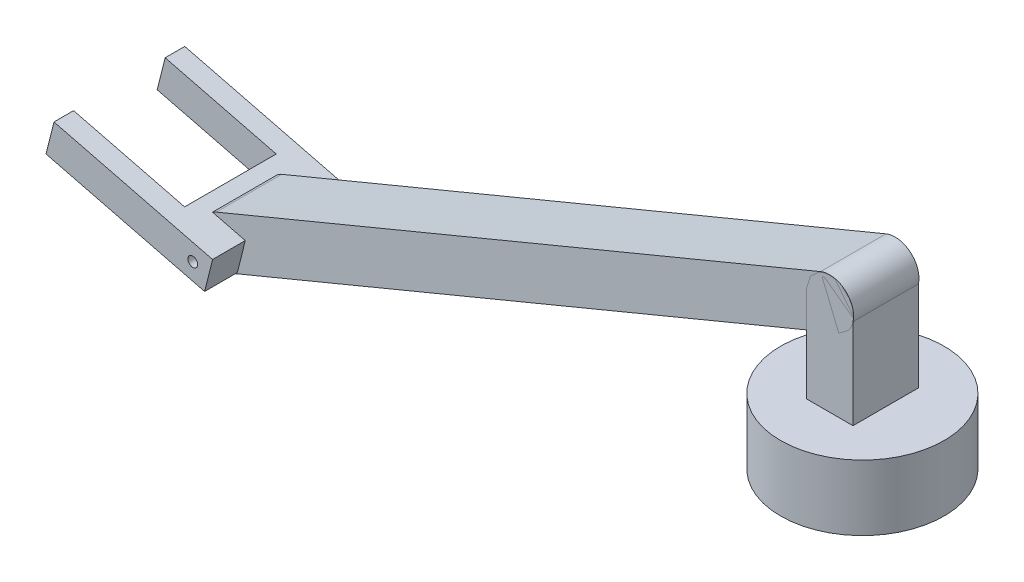
ISO-10303-21;
HEADER;
FILE_DESCRIPTION(('STEP AP214'),'2;1');
FILE_NAME('part.step','',(''),(''),'','','');
FILE_SCHEMA(('AUTOMOTIVE_DESIGN { 1 0 10303 214 1 1 1 1 }'));
ENDSEC;
DATA;
#1=APPLICATION_CONTEXT('core data for automotive mechanical design processes');
#2=APPLICATION_PROTOCOL_DEFINITION('international standard','automotive_design',2000,#1);
#3=PRODUCT_CONTEXT('',#1,'mechanical');
#4=PRODUCT('Part','Part','',(#3));
#5=PRODUCT_RELATED_PRODUCT_CATEGORY('part','',(#4));
#6=PRODUCT_DEFINITION_FORMATION('','',#4);
#7=PRODUCT_DEFINITION_CONTEXT('part definition',#1,'design');
#8=PRODUCT_DEFINITION('design','',#6,#7);
#9=PRODUCT_DEFINITION_SHAPE('','',#8);
#10=(LENGTH_UNIT() NAMED_UNIT(*) SI_UNIT(.MILLI.,.METRE.));
#11=(NAMED_UNIT(*) PLANE_ANGLE_UNIT() SI_UNIT($,.RADIAN.));
#12=(NAMED_UNIT(*) SI_UNIT($,.STERADIAN.) SOLID_ANGLE_UNIT());
#13=UNCERTAINTY_MEASURE_WITH_UNIT(LENGTH_MEASURE(1.E-05),#10,'distance_accuracy_value','');
#14=(GEOMETRIC_REPRESENTATION_CONTEXT(3) GLOBAL_UNCERTAINTY_ASSIGNED_CONTEXT((#13)) GLOBAL_UNIT_ASSIGNED_CONTEXT((#10,
#11,#12)) REPRESENTATION_CONTEXT('',''));
#15=CARTESIAN_POINT('',(0.,0.,0.));
#16=DIRECTION('',(0.,0.,1.));
#17=DIRECTION('',(1.,0.,0.));
#18=AXIS2_PLACEMENT_3D('',#15,#16,#17);
#19=CARTESIAN_POINT('',(-229.608432133908,-21.419351301532,30.));
#20=DIRECTION('',(0.969976087198979,-0.24320030892694,0.));
#21=DIRECTION('',(0.243200308926941,0.969976087198979,0.));
#22=AXIS2_PLACEMENT_3D('',#19,#20,#21);
#23=PLANE('',#22);
#24=DIRECTION('',(0.,0.,-1.));
#25=VECTOR('',#24,1.);
#26=CARTESIAN_POINT('',(-227.176429044639,-11.719590429542,30.));
#27=LINE('',#26,#25);
#28=CARTESIAN_POINT('',(-227.176429044639,-11.719590429542,-14.));
#29=VERTEX_POINT('',#28);
#30=CARTESIAN_POINT('',(-227.176429044639,-11.719590429542,-20.));
#31=VERTEX_POINT('',#30);
#32=EDGE_CURVE('E165',#29,#31,#27,.T.);
#33=ORIENTED_EDGE('',*,*,#32,.T.);
#34=DIRECTION('',(-0.243200308926941,-0.969976087198979,0.));
#35=VECTOR('',#34,1.);
#36=CARTESIAN_POINT('',(-229.608432133908,-21.419351301532,-20.));
#37=LINE('',#36,#35);
#38=CARTESIAN_POINT('',(-229.608432133908,-21.419351301532,-20.));
#39=VERTEX_POINT('',#38);
#40=EDGE_CURVE('E12',#31,#39,#37,.T.);
#41=ORIENTED_EDGE('',*,*,#40,.T.);
#42=DIRECTION('',(0.,0.,-1.));
#43=VECTOR('',#42,1.);
#44=CARTESIAN_POINT('',(-229.608432133908,-21.419351301532,30.));
#45=LINE('',#44,#43);
#46=CARTESIAN_POINT('',(-229.608432133908,-21.419351301532,-14.));
#47=VERTEX_POINT('',#46);
#48=EDGE_CURVE('E178',#47,#39,#45,.T.);
#49=ORIENTED_EDGE('',*,*,#48,.F.);
#50=DIRECTION('',(0.243200308926941,0.969976087198979,0.));
#51=VECTOR('',#50,1.);
#52=CARTESIAN_POINT('',(-229.608432133908,-21.419351301532,-14.));
#53=LINE('',#52,#51);
#54=EDGE_CURVE('E50',#47,#29,#53,.T.);
#55=ORIENTED_EDGE('',*,*,#54,.T.);
#56=EDGE_LOOP('',(#33,#41,#49,#55));
#57=FACE_BOUND('',#56,.T.);
#58=ADVANCED_FACE('F42',(#57),#23,.F.);
#59=CARTESIAN_POINT('',(-184.743506665319,-27.5134847672489,10.));
#60=DIRECTION('',(0.,0.,-1.));
#61=DIRECTION('',(-1.,0.,0.));
#62=AXIS2_PLACEMENT_3D('',#59,#60,#61);
#63=CYLINDRICAL_SURFACE('',#62,7.30197744368311);
#64=DIRECTION('',(0.,0.,-1.));
#65=VECTOR('',#64,1.);
#66=CARTESIAN_POINT('',(-191.121282650966,-31.0691630520441,10.));
#67=LINE('',#66,#65);
#68=CARTESIAN_POINT('',(-191.121282650966,-31.069163052044,-10.));
#69=VERTEX_POINT('',#68);
#70=CARTESIAN_POINT('',(-191.121282650966,-31.069163052044,10.));
#71=VERTEX_POINT('',#70);
#72=EDGE_CURVE('E202',#69,#71,#67,.F.);
#73=ORIENTED_EDGE('',*,*,#72,.F.);
#74=CARTESIAN_POINT('',(-184.743506665319,-27.5134847672489,-10.));
#75=DIRECTION('',(0.,0.,1.));
#76=DIRECTION('',(1.,0.,0.));
#77=AXIS2_PLACEMENT_3D('',#74,#75,#76);
#78=CIRCLE('',#77,7.30197744368311);
#79=CARTESIAN_POINT('',(-181.946306774093,-34.2584493599343,-10.));
#80=VERTEX_POINT('',#79);
#81=EDGE_CURVE('E225',#69,#80,#78,.T.);
#82=ORIENTED_EDGE('',*,*,#81,.T.);
#83=DIRECTION('',(0.,0.,-1.));
#84=VECTOR('',#83,1.);
#85=CARTESIAN_POINT('',(-181.946306774093,-34.2584493599343,10.));
#86=LINE('',#85,#84);
#87=CARTESIAN_POINT('',(-181.946306774093,-34.2584493599343,10.));
#88=VERTEX_POINT('',#87);
#89=EDGE_CURVE('E232',#88,#80,#86,.T.);
#90=ORIENTED_EDGE('',*,*,#89,.F.);
#91=CARTESIAN_POINT('',(-184.743506665319,-27.5134847672489,10.));
#92=DIRECTION('',(0.,0.,1.));
#93=DIRECTION('',(1.,0.,0.));
#94=AXIS2_PLACEMENT_3D('',#91,#92,#93);
#95=CIRCLE('',#94,7.30197744368311);
#96=EDGE_CURVE('E214',#71,#88,#95,.T.);
#97=ORIENTED_EDGE('',*,*,#96,.F.);
#98=EDGE_LOOP('',(#73,#82,#90,#97));
#99=FACE_BOUND('',#98,.T.);
#100=ADVANCED_FACE('F320',(#99),#63,.T.);
#101=DIRECTION('',(0.,0.,-1.));
#102=VECTOR('',#101,1.);
#103=CARTESIAN_POINT('',(-188.689279561697,-21.3694021800542,10.));
#104=LINE('',#103,#102);
#105=CARTESIAN_POINT('',(-188.689279561697,-21.3694021800542,10.));
#106=VERTEX_POINT('',#105);
#107=CARTESIAN_POINT('',(-188.689279561697,-21.3694021800542,-10.));
#108=VERTEX_POINT('',#107);
#109=EDGE_CURVE('E193',#106,#108,#104,.T.);
#110=ORIENTED_EDGE('',*,*,#109,.F.);
#111=CARTESIAN_POINT('',(-187.540706556546,-20.7685201745635,10.));
#112=VERTEX_POINT('',#111);
#113=EDGE_CURVE('E215',#112,#106,#95,.T.);
#114=ORIENTED_EDGE('',*,*,#113,.F.);
#115=DIRECTION('',(0.,0.,-1.));
#116=VECTOR('',#115,1.);
#117=CARTESIAN_POINT('',(-187.540706556546,-20.7685201745635,10.));
#118=LINE('',#117,#116);
#119=CARTESIAN_POINT('',(-187.540706556546,-20.7685201745635,-10.));
#120=VERTEX_POINT('',#119);
#121=EDGE_CURVE('E235',#112,#120,#118,.T.);
#122=ORIENTED_EDGE('',*,*,#121,.T.);
#123=EDGE_CURVE('E226',#120,#108,#78,.T.);
#124=ORIENTED_EDGE('',*,*,#123,.T.);
#125=EDGE_LOOP('',(#110,#114,#122,#124));
#126=FACE_BOUND('',#125,.T.);
#127=ADVANCED_FACE('F325',(#126),#63,.T.);
#128=CARTESIAN_POINT('',(0.,49.1013750512041,10.));
#129=DIRECTION('',(0.,0.,-1.));
#130=DIRECTION('',(-1.,0.,0.));
#131=AXIS2_PLACEMENT_3D('',#128,#129,#130);
#132=CYLINDRICAL_SURFACE('',#131,7.30197744368306);
#133=CARTESIAN_POINT('',(0.,49.1013750512041,-10.));
#134=DIRECTION('',(0.,0.,1.));
#135=DIRECTION('',(1.,0.,0.));
#136=AXIS2_PLACEMENT_3D('',#133,#134,#135);
#137=CIRCLE('',#136,7.30197744368306);
#138=CARTESIAN_POINT('',(2.79719989122643,42.3564104585188,-10.));
#139=VERTEX_POINT('',#138);
#140=CARTESIAN_POINT('',(-2.79719989122641,55.8463396438895,-10.));
#141=VERTEX_POINT('',#140);
#142=EDGE_CURVE('E207',#139,#141,#137,.T.);
#143=ORIENTED_EDGE('',*,*,#142,.T.);
#144=DIRECTION('',(0.,0.,-1.));
#145=VECTOR('',#144,1.);
#146=CARTESIAN_POINT('',(-2.79719989122641,55.8463396438895,10.));
#147=LINE('',#146,#145);
#148=CARTESIAN_POINT('',(-2.79719989122641,55.8463396438895,10.));
#149=VERTEX_POINT('',#148);
#150=EDGE_CURVE('E238',#149,#141,#147,.T.);
#151=ORIENTED_EDGE('',*,*,#150,.F.);
#152=CARTESIAN_POINT('',(0.,49.1013750512041,10.));
#153=DIRECTION('',(0.,0.,1.));
#154=DIRECTION('',(1.,0.,0.));
#155=AXIS2_PLACEMENT_3D('',#152,#153,#154);
#156=CIRCLE('',#155,7.30197744368306);
#157=CARTESIAN_POINT('',(2.79719989122643,42.3564104585188,10.));
#158=VERTEX_POINT('',#157);
#159=EDGE_CURVE('E208',#158,#149,#156,.T.);
#160=ORIENTED_EDGE('',*,*,#159,.F.);
#161=DIRECTION('',(0.,0.,-1.));
#162=VECTOR('',#161,1.);
#163=CARTESIAN_POINT('',(2.79719989122643,42.3564104585188,10.));
#164=LINE('',#163,#162);
#165=EDGE_CURVE('E220',#158,#139,#164,.T.);
#166=ORIENTED_EDGE('',*,*,#165,.T.);
#167=EDGE_LOOP('',(#143,#151,#160,#166));
#168=FACE_BOUND('',#167,.T.);
#169=ADVANCED_FACE('F44',(#168),#132,.T.);
#170=CARTESIAN_POINT('',(-2.79719989122641,55.8463396438895,10.));
#171=DIRECTION('',(0.383074299092265,-0.923717533326595,0.));
#172=DIRECTION('',(0.923717533326596,0.383074299092265,0.));
#173=AXIS2_PLACEMENT_3D('',#170,#171,#172);
#174=PLANE('',#173);
#175=DIRECTION('',(-0.923717533326596,-0.383074299092265,0.));
#176=VECTOR('',#175,1.);
#177=CARTESIAN_POINT('',(-2.79719989122641,55.8463396438895,-10.));
#178=LINE('',#177,#176);
#179=EDGE_CURVE('E223',#141,#120,#178,.T.);
#180=ORIENTED_EDGE('',*,*,#179,.T.);
#181=ORIENTED_EDGE('',*,*,#121,.F.);
#182=DIRECTION('',(-0.923717533326596,-0.383074299092265,0.));
#183=VECTOR('',#182,1.);
#184=CARTESIAN_POINT('',(-2.79719989122641,55.8463396438895,10.));
#185=LINE('',#184,#183);
#186=EDGE_CURVE('E211',#149,#112,#185,.T.);
#187=ORIENTED_EDGE('',*,*,#186,.F.);
#188=ORIENTED_EDGE('',*,*,#150,.T.);
#189=EDGE_LOOP('',(#180,#181,#187,#188));
#190=FACE_BOUND('',#189,.T.);
#191=ADVANCED_FACE('F358',(#190),#174,.F.);
#192=CARTESIAN_POINT('',(2.79719989122643,42.3564104585188,10.));
#193=DIRECTION('',(-0.383074299092265,0.923717533326595,0.));
#194=DIRECTION('',(-0.923717533326595,-0.383074299092265,0.));
#195=AXIS2_PLACEMENT_3D('',#192,#193,#194);
#196=PLANE('',#195);
#197=DIRECTION('',(0.923717533326595,0.383074299092265,0.));
#198=VECTOR('',#197,1.);
#199=CARTESIAN_POINT('',(2.79719989122643,42.3564104585188,-10.));
#200=LINE('',#199,#198);
#201=EDGE_CURVE('E212',#80,#139,#200,.T.);
#202=ORIENTED_EDGE('',*,*,#201,.T.);
#203=ORIENTED_EDGE('',*,*,#165,.F.);
#204=DIRECTION('',(0.923717533326595,0.383074299092265,0.));
#205=VECTOR('',#204,1.);
#206=CARTESIAN_POINT('',(2.79719989122643,42.3564104585188,10.));
#207=LINE('',#206,#205);
#208=EDGE_CURVE('E218',#88,#158,#207,.T.);
#209=ORIENTED_EDGE('',*,*,#208,.F.);
#210=ORIENTED_EDGE('',*,*,#89,.T.);
#211=EDGE_LOOP('',(#202,#203,#209,#210));
#212=FACE_BOUND('',#211,.T.);
#213=ADVANCED_FACE('F351',(#212),#196,.F.);
#214=CARTESIAN_POINT('',(0.,49.1013750512041,10.));
#215=DIRECTION('',(0.,0.,1.));
#216=DIRECTION('',(1.,0.,0.));
#217=AXIS2_PLACEMENT_3D('',#214,#215,#216);
#218=PLANE('',#217);
#219=DIRECTION('',(-0.243200308926927,-0.969976087198982,0.));
#220=VECTOR('',#219,1.);
#221=CARTESIAN_POINT('',(-150.893385398169,86.9345942698718,10.));
#222=LINE('',#221,#220);
#223=CARTESIAN_POINT('',(-178.67762468469,-23.8796058758887,10.));
#224=VERTEX_POINT('',#223);
#225=CARTESIAN_POINT('',(-181.109627773959,-33.5793667478785,10.));
#226=VERTEX_POINT('',#225);
#227=EDGE_CURVE('E199',#224,#226,#222,.T.);
#228=ORIENTED_EDGE('',*,*,#227,.T.);
#229=DIRECTION('',(-0.969976087198982,0.243200308926929,0.));
#230=VECTOR('',#229,1.);
#231=CARTESIAN_POINT('',(-30.21624237579,-71.4125859665464,10.));
#232=LINE('',#231,#230);
#233=EDGE_CURVE('E205',#226,#71,#232,.T.);
#234=ORIENTED_EDGE('',*,*,#233,.T.);
#235=ORIENTED_EDGE('',*,*,#96,.T.);
#236=ORIENTED_EDGE('',*,*,#208,.T.);
#237=ORIENTED_EDGE('',*,*,#159,.T.);
#238=ORIENTED_EDGE('',*,*,#186,.T.);
#239=ORIENTED_EDGE('',*,*,#113,.T.);
#240=DIRECTION('',(0.969976087198981,-0.243200308926934,0.));
#241=VECTOR('',#240,1.);
#242=CARTESIAN_POINT('',(-27.7842392865214,-61.7128250945572,10.));
#243=LINE('',#242,#241);
#244=EDGE_CURVE('E196',#106,#224,#243,.T.);
#245=ORIENTED_EDGE('',*,*,#244,.T.);
#246=EDGE_LOOP('',(#228,#234,#235,#236,#237,#238,#239,#245));
#247=FACE_BOUND('',#246,.T.);
#248=ADVANCED_FACE('F347',(#247),#218,.T.);
#249=CARTESIAN_POINT('',(0.,49.1013750512041,-10.));
#250=DIRECTION('',(0.,0.,1.));
#251=DIRECTION('',(1.,0.,0.));
#252=AXIS2_PLACEMENT_3D('',#249,#250,#251);
#253=PLANE('',#252);
#254=DIRECTION('',(-0.969976087198982,0.243200308926929,0.));
#255=VECTOR('',#254,1.);
#256=CARTESIAN_POINT('',(-30.21624237579,-71.4125859665464,-10.));
#257=LINE('',#256,#255);
#258=CARTESIAN_POINT('',(-181.109627773959,-33.5793667478785,-10.));
#259=VERTEX_POINT('',#258);
#260=EDGE_CURVE('E192',#259,#69,#257,.T.);
#261=ORIENTED_EDGE('',*,*,#260,.F.);
#262=DIRECTION('',(-0.243200308926927,-0.969976087198982,0.));
#263=VECTOR('',#262,1.);
#264=CARTESIAN_POINT('',(-150.893385398169,86.9345942698718,-10.));
#265=LINE('',#264,#263);
#266=CARTESIAN_POINT('',(-178.67762468469,-23.8796058758887,-9.99999999999998));
#267=VERTEX_POINT('',#266);
#268=EDGE_CURVE('E245',#267,#259,#265,.T.);
#269=ORIENTED_EDGE('',*,*,#268,.F.);
#270=DIRECTION('',(0.969976087198981,-0.243200308926934,0.));
#271=VECTOR('',#270,1.);
#272=CARTESIAN_POINT('',(-27.7842392865214,-61.7128250945572,-10.));
#273=LINE('',#272,#271);
#274=EDGE_CURVE('E241',#108,#267,#273,.T.);
#275=ORIENTED_EDGE('',*,*,#274,.F.);
#276=ORIENTED_EDGE('',*,*,#123,.F.);
#277=ORIENTED_EDGE('',*,*,#179,.F.);
#278=ORIENTED_EDGE('',*,*,#142,.F.);
#279=ORIENTED_EDGE('',*,*,#201,.F.);
#280=ORIENTED_EDGE('',*,*,#81,.F.);
#281=EDGE_LOOP('',(#261,#269,#275,#276,#277,#278,#279,#280));
#282=FACE_BOUND('',#281,.T.);
#283=ADVANCED_FACE('F350',(#282),#253,.F.);
#284=CARTESIAN_POINT('',(-181.109627773959,-33.5793667478785,30.));
#285=DIRECTION('',(-0.969976087198982,0.243200308926927,0.));
#286=DIRECTION('',(-0.243200308926927,-0.969976087198982,0.));
#287=AXIS2_PLACEMENT_3D('',#284,#285,#286);
#288=PLANE('',#287);
#289=DIRECTION('',(0.,0.,-1.));
#290=VECTOR('',#289,1.);
#291=CARTESIAN_POINT('',(-181.109627773959,-33.5793667478785,30.));
#292=LINE('',#291,#290);
#293=CARTESIAN_POINT('',(-181.109627773959,-33.5793667478785,-20.));
#294=VERTEX_POINT('',#293);
#295=EDGE_CURVE('E184',#259,#294,#292,.T.);
#296=ORIENTED_EDGE('',*,*,#295,.T.);
#297=DIRECTION('',(0.243200308926927,0.969976087198982,0.));
#298=VECTOR('',#297,1.);
#299=CARTESIAN_POINT('',(-181.109627773959,-33.5793667478785,-20.));
#300=LINE('',#299,#298);
#301=CARTESIAN_POINT('',(-178.67762468469,-23.8796058758887,-20.));
#302=VERTEX_POINT('',#301);
#303=EDGE_CURVE('E281',#294,#302,#300,.T.);
#304=ORIENTED_EDGE('',*,*,#303,.T.);
#305=DIRECTION('',(0.,0.,-1.));
#306=VECTOR('',#305,1.);
#307=CARTESIAN_POINT('',(-178.67762468469,-23.8796058758887,30.));
#308=LINE('',#307,#306);
#309=EDGE_CURVE('E168',#267,#302,#308,.T.);
#310=ORIENTED_EDGE('',*,*,#309,.F.);
#311=ORIENTED_EDGE('',*,*,#268,.T.);
#312=EDGE_LOOP('',(#296,#304,#310,#311));
#313=FACE_BOUND('',#312,.T.);
#314=ADVANCED_FACE('F343',(#313),#288,.F.);
#315=CARTESIAN_POINT('',(-181.109627773959,-33.5793667478785,30.));
#316=DIRECTION('',(0.243200308926929,0.969976087198982,0.));
#317=DIRECTION('',(-0.969976087198982,0.243200308926929,0.));
#318=AXIS2_PLACEMENT_3D('',#315,#316,#317);
#319=PLANE('',#318);
#320=CARTESIAN_POINT('',(-181.109627773959,-33.5793667478785,20.));
#321=VERTEX_POINT('',#320);
#322=EDGE_CURVE('E185',#321,#226,#292,.T.);
#323=ORIENTED_EDGE('',*,*,#322,.F.);
#324=DIRECTION('',(-0.969976087198982,0.243200308926929,0.));
#325=VECTOR('',#324,1.);
#326=CARTESIAN_POINT('',(-181.109627773959,-33.5793667478785,20.));
#327=LINE('',#326,#325);
#328=CARTESIAN_POINT('',(-229.608432133908,-21.419351301532,20.));
#329=VERTEX_POINT('',#328);
#330=EDGE_CURVE('E269',#321,#329,#327,.T.);
#331=ORIENTED_EDGE('',*,*,#330,.T.);
#332=CARTESIAN_POINT('',(-229.608432133908,-21.419351301532,14.));
#333=VERTEX_POINT('',#332);
#334=EDGE_CURVE('E174',#329,#333,#45,.T.);
#335=ORIENTED_EDGE('',*,*,#334,.T.);
#336=DIRECTION('',(0.969976087198982,-0.243200308926929,0.));
#337=VECTOR('',#336,1.);
#338=CARTESIAN_POINT('',(-181.109627773959,-33.5793667478785,14.));
#339=LINE('',#338,#337);
#340=CARTESIAN_POINT('',(-195.659269081944,-29.9313621139745,14.));
#341=VERTEX_POINT('',#340);
#342=EDGE_CURVE('E268',#333,#341,#339,.T.);
#343=ORIENTED_EDGE('',*,*,#342,.T.);
#344=DIRECTION('',(0.,0.,-1.));
#345=VECTOR('',#344,1.);
#346=CARTESIAN_POINT('',(-195.659269081944,-29.9313621139745,30.));
#347=LINE('',#346,#345);
#348=CARTESIAN_POINT('',(-195.659269081944,-29.9313621139745,-14.));
#349=VERTEX_POINT('',#348);
#350=EDGE_CURVE('E285',#341,#349,#347,.T.);
#351=ORIENTED_EDGE('',*,*,#350,.T.);
#352=DIRECTION('',(-0.969976087198982,0.243200308926929,0.));
#353=VECTOR('',#352,1.);
#354=CARTESIAN_POINT('',(-181.109627773959,-33.5793667478785,-14.));
#355=LINE('',#354,#353);
#356=EDGE_CURVE('E273',#349,#47,#355,.T.);
#357=ORIENTED_EDGE('',*,*,#356,.T.);
#358=ORIENTED_EDGE('',*,*,#48,.T.);
#359=DIRECTION('',(0.969976087198982,-0.243200308926929,0.));
#360=VECTOR('',#359,1.);
#361=CARTESIAN_POINT('',(-181.109627773959,-33.5793667478785,-20.));
#362=LINE('',#361,#360);
#363=EDGE_CURVE('E65',#39,#294,#362,.T.);
#364=ORIENTED_EDGE('',*,*,#363,.T.);
#365=ORIENTED_EDGE('',*,*,#295,.F.);
#366=ORIENTED_EDGE('',*,*,#260,.T.);
#367=ORIENTED_EDGE('',*,*,#72,.T.);
#368=ORIENTED_EDGE('',*,*,#233,.F.);
#369=EDGE_LOOP('',(#323,#331,#335,#343,#351,#357,#358,#364,#365,#366,#367,#368));
#370=FACE_BOUND('',#369,.T.);
#371=ADVANCED_FACE('F266',(#370),#319,.F.);
#372=CARTESIAN_POINT('',(-178.67762468469,-23.8796058758887,20.));
#373=VERTEX_POINT('',#372);
#374=EDGE_CURVE('E182',#373,#224,#308,.T.);
#375=ORIENTED_EDGE('',*,*,#374,.F.);
#376=DIRECTION('',(-0.243200308926927,-0.969976087198982,0.));
#377=VECTOR('',#376,1.);
#378=CARTESIAN_POINT('',(-181.109627773959,-33.5793667478785,20.));
#379=LINE('',#378,#377);
#380=EDGE_CURVE('E253',#373,#321,#379,.T.);
#381=ORIENTED_EDGE('',*,*,#380,.T.);
#382=ORIENTED_EDGE('',*,*,#322,.T.);
#383=ORIENTED_EDGE('',*,*,#227,.F.);
#384=EDGE_LOOP('',(#375,#381,#382,#383));
#385=FACE_BOUND('',#384,.T.);
#386=ADVANCED_FACE('F337',(#385),#288,.F.);
#387=CARTESIAN_POINT('',(-178.67762468469,-23.8796058758887,30.));
#388=DIRECTION('',(-0.243200308926934,-0.96997608719898,0.));
#389=DIRECTION('',(0.969976087198981,-0.243200308926934,0.));
#390=AXIS2_PLACEMENT_3D('',#387,#388,#389);
#391=PLANE('',#390);
#392=CARTESIAN_POINT('',(-227.176429044639,-11.719590429542,20.));
#393=VERTEX_POINT('',#392);
#394=CARTESIAN_POINT('',(-227.176429044639,-11.719590429542,14.));
#395=VERTEX_POINT('',#394);
#396=EDGE_CURVE('E173',#393,#395,#27,.T.);
#397=ORIENTED_EDGE('',*,*,#396,.F.);
#398=DIRECTION('',(-0.969976087198981,0.243200308926934,0.));
#399=VECTOR('',#398,1.);
#400=CARTESIAN_POINT('',(-227.176429044639,-11.719590429542,20.));
#401=LINE('',#400,#399);
#402=EDGE_CURVE('E57',#373,#393,#401,.T.);
#403=ORIENTED_EDGE('',*,*,#402,.F.);
#404=ORIENTED_EDGE('',*,*,#374,.T.);
#405=ORIENTED_EDGE('',*,*,#244,.F.);
#406=ORIENTED_EDGE('',*,*,#109,.T.);
#407=ORIENTED_EDGE('',*,*,#274,.T.);
#408=ORIENTED_EDGE('',*,*,#309,.T.);
#409=DIRECTION('',(0.969976087198981,-0.243200308926934,0.));
#410=VECTOR('',#409,1.);
#411=CARTESIAN_POINT('',(-227.176429044639,-11.719590429542,-20.));
#412=LINE('',#411,#410);
#413=EDGE_CURVE('E153',#31,#302,#412,.T.);
#414=ORIENTED_EDGE('',*,*,#413,.F.);
#415=ORIENTED_EDGE('',*,*,#32,.F.);
#416=DIRECTION('',(-0.96997608719898,0.243200308926934,0.));
#417=VECTOR('',#416,1.);
#418=CARTESIAN_POINT('',(-227.176429044639,-11.719590429542,-14.));
#419=LINE('',#418,#417);
#420=CARTESIAN_POINT('',(-193.227265992674,-20.2316012419847,-14.));
#421=VERTEX_POINT('',#420);
#422=EDGE_CURVE('E299',#421,#29,#419,.T.);
#423=ORIENTED_EDGE('',*,*,#422,.F.);
#424=DIRECTION('',(0.,0.,-1.));
#425=VECTOR('',#424,1.);
#426=CARTESIAN_POINT('',(-193.227265992674,-20.2316012419847,-14.));
#427=LINE('',#426,#425);
#428=CARTESIAN_POINT('',(-193.227265992674,-20.2316012419847,14.));
#429=VERTEX_POINT('',#428);
#430=EDGE_CURVE('E296',#429,#421,#427,.T.);
#431=ORIENTED_EDGE('',*,*,#430,.F.);
#432=DIRECTION('',(0.96997608719898,-0.243200308926934,0.));
#433=VECTOR('',#432,1.);
#434=CARTESIAN_POINT('',(-227.176429044639,-11.719590429542,14.));
#435=LINE('',#434,#433);
#436=EDGE_CURVE('E169',#395,#429,#435,.T.);
#437=ORIENTED_EDGE('',*,*,#436,.F.);
#438=EDGE_LOOP('',(#397,#403,#404,#405,#406,#407,#408,#414,#415,#423,#431,#437));
#439=FACE_BOUND('',#438,.T.);
#440=ADVANCED_FACE('F163',(#439),#391,.F.);
#441=ORIENTED_EDGE('',*,*,#334,.F.);
#442=DIRECTION('',(0.243200308926934,0.96997608719898,0.));
#443=VECTOR('',#442,1.);
#444=CARTESIAN_POINT('',(-232.768554389715,-34.0231306070896,20.));
#445=LINE('',#444,#443);
#446=EDGE_CURVE('E170',#329,#393,#445,.T.);
#447=ORIENTED_EDGE('',*,*,#446,.T.);
#448=ORIENTED_EDGE('',*,*,#396,.T.);
#449=DIRECTION('',(-0.243200308926941,-0.969976087198979,0.));
#450=VECTOR('',#449,1.);
#451=CARTESIAN_POINT('',(-229.608432133908,-21.419351301532,14.));
#452=LINE('',#451,#450);
#453=EDGE_CURVE('E191',#395,#333,#452,.T.);
#454=ORIENTED_EDGE('',*,*,#453,.T.);
#455=EDGE_LOOP('',(#441,#447,#448,#454));
#456=FACE_BOUND('',#455,.T.);
#457=ADVANCED_FACE('F258',(#456),#23,.F.);
#458=CARTESIAN_POINT('',(-232.768554389715,-34.0231306070896,20.));
#459=DIRECTION('',(0.,0.,-1.));
#460=DIRECTION('',(-1.,0.,0.));
#461=AXIS2_PLACEMENT_3D('',#458,#459,#460);
#462=PLANE('',#461);
#463=CARTESIAN_POINT('',(-184.743506665319,-27.5134847672489,20.));
#464=DIRECTION('',(0.,0.,-1.));
#465=DIRECTION('',(-1.,0.,0.));
#466=AXIS2_PLACEMENT_3D('',#463,#464,#465);
#467=CIRCLE('',#466,1.5);
#468=CARTESIAN_POINT('',(-186.243506665319,-27.5134847672489,20.));
#469=VERTEX_POINT('',#468);
#470=EDGE_CURVE('E250',#469,#469,#467,.T.);
#471=ORIENTED_EDGE('',*,*,#470,.T.);
#472=EDGE_LOOP('',(#471));
#473=FACE_BOUND('',#472,.T.);
#474=ORIENTED_EDGE('',*,*,#380,.F.);
#475=ORIENTED_EDGE('',*,*,#402,.T.);
#476=ORIENTED_EDGE('',*,*,#446,.F.);
#477=ORIENTED_EDGE('',*,*,#330,.F.);
#478=EDGE_LOOP('',(#474,#475,#476,#477));
#479=FACE_BOUND('',#478,.T.);
#480=ADVANCED_FACE('F330',(#473,#479),#462,.F.);
#481=CARTESIAN_POINT('',(-198.819391337751,-42.5351414195322,-14.));
#482=DIRECTION('',(0.96997608719898,-0.243200308926934,0.));
#483=DIRECTION('',(0.243200308926934,0.96997608719898,0.));
#484=AXIS2_PLACEMENT_3D('',#481,#482,#483);
#485=PLANE('',#484);
#486=DIRECTION('',(0.243200308926934,0.96997608719898,0.));
#487=VECTOR('',#486,1.);
#488=CARTESIAN_POINT('',(-198.819391337751,-42.5351414195322,14.));
#489=LINE('',#488,#487);
#490=EDGE_CURVE('E297',#341,#429,#489,.T.);
#491=ORIENTED_EDGE('',*,*,#490,.T.);
#492=ORIENTED_EDGE('',*,*,#430,.T.);
#493=DIRECTION('',(0.243200308926934,0.96997608719898,0.));
#494=VECTOR('',#493,1.);
#495=CARTESIAN_POINT('',(-198.819391337751,-42.5351414195322,-14.));
#496=LINE('',#495,#494);
#497=EDGE_CURVE('E254',#349,#421,#496,.T.);
#498=ORIENTED_EDGE('',*,*,#497,.F.);
#499=ORIENTED_EDGE('',*,*,#350,.F.);
#500=EDGE_LOOP('',(#491,#492,#498,#499));
#501=FACE_BOUND('',#500,.T.);
#502=ADVANCED_FACE('F293',(#501),#485,.F.);
#503=CARTESIAN_POINT('',(-232.768554389715,-34.0231306070895,-14.));
#504=DIRECTION('',(0.,0.,-1.));
#505=DIRECTION('',(-1.,0.,0.));
#506=AXIS2_PLACEMENT_3D('',#503,#504,#505);
#507=PLANE('',#506);
#508=ORIENTED_EDGE('',*,*,#497,.T.);
#509=ORIENTED_EDGE('',*,*,#422,.T.);
#510=ORIENTED_EDGE('',*,*,#54,.F.);
#511=ORIENTED_EDGE('',*,*,#356,.F.);
#512=EDGE_LOOP('',(#508,#509,#510,#511));
#513=FACE_BOUND('',#512,.T.);
#514=ADVANCED_FACE('F290',(#513),#507,.F.);
#515=CARTESIAN_POINT('',(-232.768554389715,-34.0231306070895,14.));
#516=DIRECTION('',(0.,0.,1.));
#517=DIRECTION('',(1.,0.,0.));
#518=AXIS2_PLACEMENT_3D('',#515,#516,#517);
#519=PLANE('',#518);
#520=ORIENTED_EDGE('',*,*,#453,.F.);
#521=ORIENTED_EDGE('',*,*,#436,.T.);
#522=ORIENTED_EDGE('',*,*,#490,.F.);
#523=ORIENTED_EDGE('',*,*,#342,.F.);
#524=EDGE_LOOP('',(#520,#521,#522,#523));
#525=FACE_BOUND('',#524,.T.);
#526=ADVANCED_FACE('F306',(#525),#519,.F.);
#527=CARTESIAN_POINT('',(-232.768554389715,-34.0231306070896,-20.));
#528=DIRECTION('',(0.,0.,1.));
#529=DIRECTION('',(1.,0.,0.));
#530=AXIS2_PLACEMENT_3D('',#527,#528,#529);
#531=PLANE('',#530);
#532=CARTESIAN_POINT('',(-184.743506665319,-27.5134847672489,-20.));
#533=DIRECTION('',(0.,0.,1.));
#534=DIRECTION('',(1.,0.,0.));
#535=AXIS2_PLACEMENT_3D('',#532,#533,#534);
#536=CIRCLE('',#535,1.5);
#537=CARTESIAN_POINT('',(-183.243506665319,-27.5134847672489,-20.));
#538=VERTEX_POINT('',#537);
#539=EDGE_CURVE('E283',#538,#538,#536,.T.);
#540=ORIENTED_EDGE('',*,*,#539,.T.);
#541=EDGE_LOOP('',(#540));
#542=FACE_BOUND('',#541,.T.);
#543=ORIENTED_EDGE('',*,*,#363,.F.);
#544=ORIENTED_EDGE('',*,*,#40,.F.);
#545=ORIENTED_EDGE('',*,*,#413,.T.);
#546=ORIENTED_EDGE('',*,*,#303,.F.);
#547=EDGE_LOOP('',(#543,#544,#545,#546));
#548=FACE_BOUND('',#547,.T.);
#549=ADVANCED_FACE('F152',(#542,#548),#531,.F.);
#550=CARTESIAN_POINT('',(-184.743506665319,-27.5134847672489,-10.));
#551=DIRECTION('',(0.,0.,1.));
#552=DIRECTION('',(1.,0.,0.));
#553=AXIS2_PLACEMENT_3D('',#550,#551,#552);
#554=CIRCLE('',#553,1.5);
#555=CARTESIAN_POINT('',(-183.243506665319,-27.5134847672489,-10.));
#556=VERTEX_POINT('',#555);
#557=EDGE_CURVE('E187',#556,#556,#554,.F.);
#558=ORIENTED_EDGE('',*,*,#557,.T.);
#559=EDGE_LOOP('',(#558));
#560=FACE_BOUND('',#559,.T.);
#561=ADVANCED_FACE('F313',(#560),#253,.F.);
#562=CARTESIAN_POINT('',(-184.743506665319,-27.5134847672489,30.));
#563=DIRECTION('',(0.,0.,-1.));
#564=DIRECTION('',(-1.,0.,0.));
#565=AXIS2_PLACEMENT_3D('',#562,#563,#564);
#566=CYLINDRICAL_SURFACE('',#565,1.5);
#567=ORIENTED_EDGE('',*,*,#539,.F.);
#568=EDGE_LOOP('',(#567));
#569=FACE_BOUND('',#568,.T.);
#570=ORIENTED_EDGE('',*,*,#557,.F.);
#571=EDGE_LOOP('',(#570));
#572=FACE_BOUND('',#571,.T.);
#573=ADVANCED_FACE('F440',(#569,#572),#566,.F.);
#574=CARTESIAN_POINT('',(-184.743506665319,-27.5134847672489,10.));
#575=DIRECTION('',(0.,0.,1.));
#576=DIRECTION('',(1.,0.,0.));
#577=AXIS2_PLACEMENT_3D('',#574,#575,#576);
#578=CIRCLE('',#577,1.5);
#579=CARTESIAN_POINT('',(-183.243506665319,-27.5134847672489,10.));
#580=VERTEX_POINT('',#579);
#581=EDGE_CURVE('E188',#580,#580,#578,.F.);
#582=ORIENTED_EDGE('',*,*,#581,.F.);
#583=EDGE_LOOP('',(#582));
#584=FACE_BOUND('',#583,.T.);
#585=ADVANCED_FACE('F353',(#584),#218,.T.);
#586=ORIENTED_EDGE('',*,*,#470,.F.);
#587=EDGE_LOOP('',(#586));
#588=FACE_BOUND('',#587,.T.);
#589=ORIENTED_EDGE('',*,*,#581,.T.);
#590=EDGE_LOOP('',(#589));
#591=FACE_BOUND('',#590,.T.);
#592=ADVANCED_FACE('F446',(#588,#591),#566,.F.);
#593=CLOSED_SHELL('',(#58,#100,#127,#169,#191,#213,#248,#283,#314,#371,#386,#440,#457,#480,#502,
#514,#526,#549,#561,#573,#585,#592));
#594=MANIFOLD_SOLID_BREP('B2',#593);
#595=CARTESIAN_POINT('',(0.,20.,0.));
#596=DIRECTION('',(0.,-1.,0.));
#597=DIRECTION('',(0.,0.,-1.));
#598=AXIS2_PLACEMENT_3D('',#595,#596,#597);
#599=CYLINDRICAL_SURFACE('',#598,25.);
#600=CARTESIAN_POINT('',(0.,20.,0.));
#601=DIRECTION('',(0.,1.,0.));
#602=DIRECTION('',(0.,0.,1.));
#603=AXIS2_PLACEMENT_3D('',#600,#601,#602);
#604=CIRCLE('',#603,25.);
#605=CARTESIAN_POINT('',(0.,20.,25.));
#606=VERTEX_POINT('',#605);
#607=EDGE_CURVE('E598',#606,#606,#604,.T.);
#608=ORIENTED_EDGE('',*,*,#607,.F.);
#609=EDGE_LOOP('',(#608));
#610=FACE_BOUND('',#609,.T.);
#611=CARTESIAN_POINT('',(0.,0.,0.));
#612=DIRECTION('',(0.,1.,0.));
#613=DIRECTION('',(0.,0.,1.));
#614=AXIS2_PLACEMENT_3D('',#611,#612,#613);
#615=CIRCLE('',#614,25.);
#616=CARTESIAN_POINT('',(0.,0.,25.));
#617=VERTEX_POINT('',#616);
#618=EDGE_CURVE('E597',#617,#617,#615,.T.);
#619=ORIENTED_EDGE('',*,*,#618,.T.);
#620=EDGE_LOOP('',(#619));
#621=FACE_BOUND('',#620,.T.);
#622=ADVANCED_FACE('F525',(#610,#621),#599,.T.);
#623=CARTESIAN_POINT('',(0.,20.,0.));
#624=DIRECTION('',(0.,1.,0.));
#625=DIRECTION('',(0.,0.,1.));
#626=AXIS2_PLACEMENT_3D('',#623,#624,#625);
#627=PLANE('',#626);
#628=DIRECTION('',(1.,0.,0.));
#629=VECTOR('',#628,1.);
#630=CARTESIAN_POINT('',(0.,20.,10.));
#631=LINE('',#630,#629);
#632=CARTESIAN_POINT('',(-7.12564814931336,20.,10.));
#633=VERTEX_POINT('',#632);
#634=CARTESIAN_POINT('',(7.12564814931336,20.,10.));
#635=VERTEX_POINT('',#634);
#636=EDGE_CURVE('E40',#633,#635,#631,.T.);
#637=ORIENTED_EDGE('',*,*,#636,.F.);
#638=DIRECTION('',(0.,0.,-1.));
#639=VECTOR('',#638,1.);
#640=CARTESIAN_POINT('',(-7.12564814931336,20.,10.));
#641=LINE('',#640,#639);
#642=CARTESIAN_POINT('',(-7.12564814931336,20.,-10.));
#643=VERTEX_POINT('',#642);
#644=EDGE_CURVE('E586',#633,#643,#641,.T.);
#645=ORIENTED_EDGE('',*,*,#644,.T.);
#646=DIRECTION('',(1.,0.,0.));
#647=VECTOR('',#646,1.);
#648=CARTESIAN_POINT('',(0.,20.,-10.));
#649=LINE('',#648,#647);
#650=CARTESIAN_POINT('',(7.12564814931336,20.,-10.));
#651=VERTEX_POINT('',#650);
#652=EDGE_CURVE('E532',#643,#651,#649,.T.);
#653=ORIENTED_EDGE('',*,*,#652,.T.);
#654=DIRECTION('',(0.,0.,-1.));
#655=VECTOR('',#654,1.);
#656=CARTESIAN_POINT('',(7.12564814931336,20.,10.));
#657=LINE('',#656,#655);
#658=EDGE_CURVE('E539',#635,#651,#657,.T.);
#659=ORIENTED_EDGE('',*,*,#658,.F.);
#660=EDGE_LOOP('',(#637,#645,#653,#659));
#661=FACE_BOUND('',#660,.T.);
#662=ORIENTED_EDGE('',*,*,#607,.T.);
#663=EDGE_LOOP('',(#662));
#664=FACE_BOUND('',#663,.T.);
#665=ADVANCED_FACE('F603',(#661,#664),#627,.T.);
#666=CARTESIAN_POINT('',(0.,0.,0.));
#667=DIRECTION('',(0.,1.,0.));
#668=DIRECTION('',(0.,0.,1.));
#669=AXIS2_PLACEMENT_3D('',#666,#667,#668);
#670=PLANE('',#669);
#671=ORIENTED_EDGE('',*,*,#618,.F.);
#672=EDGE_LOOP('',(#671));
#673=FACE_BOUND('',#672,.T.);
#674=ADVANCED_FACE('F620',(#673),#670,.F.);
#675=CARTESIAN_POINT('',(7.12564814931336,20.,10.));
#676=DIRECTION('',(-1.,0.,0.));
#677=DIRECTION('',(0.,0.,1.));
#678=AXIS2_PLACEMENT_3D('',#675,#676,#677);
#679=PLANE('',#678);
#680=DIRECTION('',(0.,1.,0.));
#681=VECTOR('',#680,1.);
#682=CARTESIAN_POINT('',(7.12564814931336,20.,-10.));
#683=LINE('',#682,#681);
#684=CARTESIAN_POINT('',(7.12564814931336,49.1013750512041,-10.));
#685=VERTEX_POINT('',#684);
#686=EDGE_CURVE('E578',#651,#685,#683,.T.);
#687=ORIENTED_EDGE('',*,*,#686,.T.);
#688=DIRECTION('',(0.,0.,-1.));
#689=VECTOR('',#688,1.);
#690=CARTESIAN_POINT('',(7.12564814931336,49.1013750512041,10.));
#691=LINE('',#690,#689);
#692=CARTESIAN_POINT('',(7.12564814931336,49.1013750512041,10.));
#693=VERTEX_POINT('',#692);
#694=EDGE_CURVE('E576',#693,#685,#691,.T.);
#695=ORIENTED_EDGE('',*,*,#694,.F.);
#696=DIRECTION('',(0.,1.,0.));
#697=VECTOR('',#696,1.);
#698=CARTESIAN_POINT('',(7.12564814931336,20.,10.));
#699=LINE('',#698,#697);
#700=EDGE_CURVE('E567',#635,#693,#699,.T.);
#701=ORIENTED_EDGE('',*,*,#700,.F.);
#702=ORIENTED_EDGE('',*,*,#658,.T.);
#703=EDGE_LOOP('',(#687,#695,#701,#702));
#704=FACE_BOUND('',#703,.T.);
#705=ADVANCED_FACE('F577',(#704),#679,.F.);
#706=CARTESIAN_POINT('',(0.,49.1013750512041,10.));
#707=DIRECTION('',(0.,0.,-1.));
#708=DIRECTION('',(-1.,0.,0.));
#709=AXIS2_PLACEMENT_3D('',#706,#707,#708);
#710=CYLINDRICAL_SURFACE('',#709,7.12564814931336);
#711=CARTESIAN_POINT('',(0.,49.1013750512041,-10.));
#712=DIRECTION('',(0.,0.,1.));
#713=DIRECTION('',(1.,0.,0.));
#714=AXIS2_PLACEMENT_3D('',#711,#712,#713);
#715=CIRCLE('',#714,7.12564814931336);
#716=CARTESIAN_POINT('',(-7.12564814931336,49.1013750512041,-10.));
#717=VERTEX_POINT('',#716);
#718=EDGE_CURVE('E590',#685,#717,#715,.T.);
#719=ORIENTED_EDGE('',*,*,#718,.T.);
#720=DIRECTION('',(0.,0.,-1.));
#721=VECTOR('',#720,1.);
#722=CARTESIAN_POINT('',(-7.12564814931336,49.1013750512041,10.));
#723=LINE('',#722,#721);
#724=CARTESIAN_POINT('',(-7.12564814931336,49.1013750512041,10.));
#725=VERTEX_POINT('',#724);
#726=EDGE_CURVE('E581',#725,#717,#723,.T.);
#727=ORIENTED_EDGE('',*,*,#726,.F.);
#728=CARTESIAN_POINT('',(0.,49.1013750512041,10.));
#729=DIRECTION('',(0.,0.,1.));
#730=DIRECTION('',(1.,0.,0.));
#731=AXIS2_PLACEMENT_3D('',#728,#729,#730);
#732=CIRCLE('',#731,7.12564814931336);
#733=EDGE_CURVE('E571',#693,#725,#732,.T.);
#734=ORIENTED_EDGE('',*,*,#733,.F.);
#735=ORIENTED_EDGE('',*,*,#694,.T.);
#736=EDGE_LOOP('',(#719,#727,#734,#735));
#737=FACE_BOUND('',#736,.T.);
#738=ADVANCED_FACE('F583',(#737),#710,.T.);
#739=CARTESIAN_POINT('',(-7.12564814931336,20.,10.));
#740=DIRECTION('',(1.,0.,0.));
#741=DIRECTION('',(0.,0.,-1.));
#742=AXIS2_PLACEMENT_3D('',#739,#740,#741);
#743=PLANE('',#742);
#744=DIRECTION('',(0.,-1.,0.));
#745=VECTOR('',#744,1.);
#746=CARTESIAN_POINT('',(-7.12564814931336,20.,-10.));
#747=LINE('',#746,#745);
#748=EDGE_CURVE('E573',#717,#643,#747,.T.);
#749=ORIENTED_EDGE('',*,*,#748,.T.);
#750=ORIENTED_EDGE('',*,*,#644,.F.);
#751=DIRECTION('',(0.,-1.,0.));
#752=VECTOR('',#751,1.);
#753=CARTESIAN_POINT('',(-7.12564814931336,20.,10.));
#754=LINE('',#753,#752);
#755=EDGE_CURVE('E547',#725,#633,#754,.T.);
#756=ORIENTED_EDGE('',*,*,#755,.F.);
#757=ORIENTED_EDGE('',*,*,#726,.T.);
#758=EDGE_LOOP('',(#749,#750,#756,#757));
#759=FACE_BOUND('',#758,.T.);
#760=ADVANCED_FACE('F606',(#759),#743,.F.);
#761=CARTESIAN_POINT('',(0.,20.,10.));
#762=DIRECTION('',(0.,0.,1.));
#763=DIRECTION('',(1.,0.,0.));
#764=AXIS2_PLACEMENT_3D('',#761,#762,#763);
#765=PLANE('',#764);
#766=ORIENTED_EDGE('',*,*,#755,.T.);
#767=ORIENTED_EDGE('',*,*,#636,.T.);
#768=ORIENTED_EDGE('',*,*,#700,.T.);
#769=ORIENTED_EDGE('',*,*,#733,.T.);
#770=EDGE_LOOP('',(#766,#767,#768,#769));
#771=FACE_BOUND('',#770,.T.);
#772=ADVANCED_FACE('F569',(#771),#765,.T.);
#773=CARTESIAN_POINT('',(0.,20.,-10.));
#774=DIRECTION('',(0.,0.,1.));
#775=DIRECTION('',(1.,0.,0.));
#776=AXIS2_PLACEMENT_3D('',#773,#774,#775);
#777=PLANE('',#776);
#778=ORIENTED_EDGE('',*,*,#652,.F.);
#779=ORIENTED_EDGE('',*,*,#748,.F.);
#780=ORIENTED_EDGE('',*,*,#718,.F.);
#781=ORIENTED_EDGE('',*,*,#686,.F.);
#782=EDGE_LOOP('',(#778,#779,#780,#781));
#783=FACE_BOUND('',#782,.T.);
#784=ADVANCED_FACE('F607',(#783),#777,.F.);
#785=CLOSED_SHELL('',(#622,#665,#674,#705,#738,#760,#772,#784));
#786=MANIFOLD_SOLID_BREP('B6',#785);
#787=ADVANCED_BREP_SHAPE_REPRESENTATION('',(#18,#594,#786),#14);
#788=SHAPE_DEFINITION_REPRESENTATION(#9,#787);
ENDSEC;
END-ISO-10303-21;
